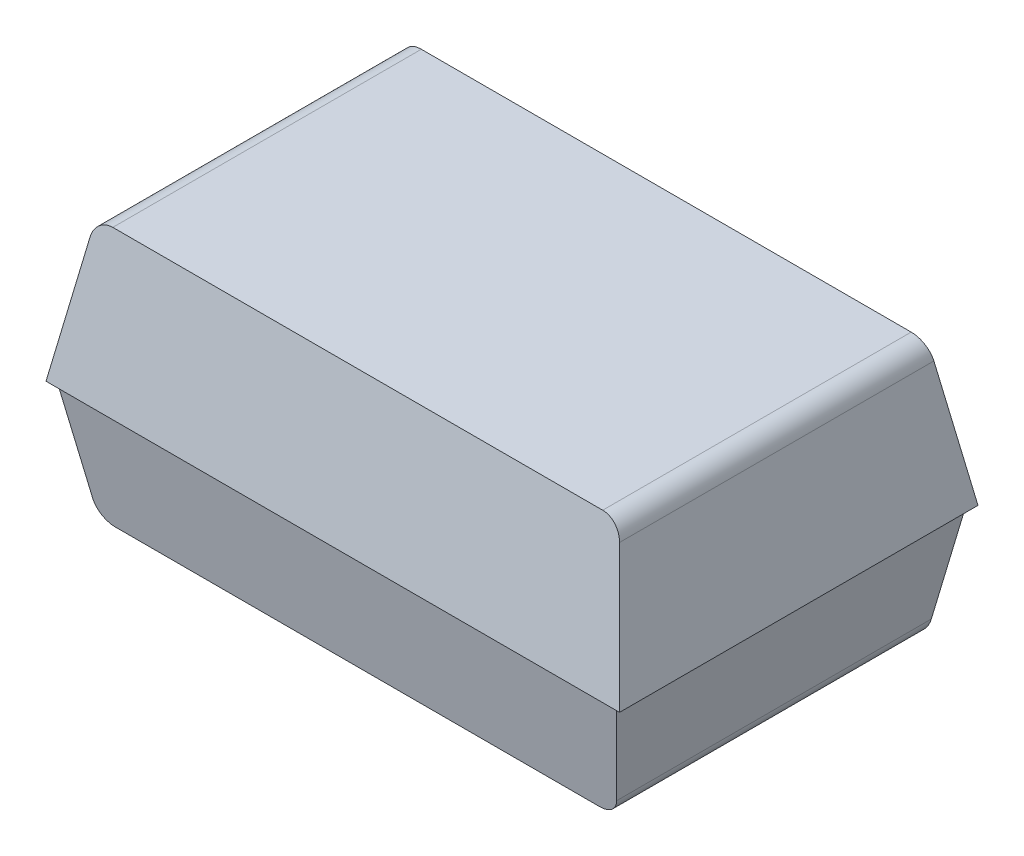
ISO-10303-21;
HEADER;
FILE_DESCRIPTION(('STEP AP214'),'2;1');
FILE_NAME('part.step','',(''),(''),'','','');
FILE_SCHEMA(('AUTOMOTIVE_DESIGN { 1 0 10303 214 1 1 1 1 }'));
ENDSEC;
DATA;
#1=APPLICATION_CONTEXT('core data for automotive mechanical design processes');
#2=APPLICATION_PROTOCOL_DEFINITION('international standard','automotive_design',2000,#1);
#3=PRODUCT_CONTEXT('',#1,'mechanical');
#4=PRODUCT('Part','Part','',(#3));
#5=PRODUCT_RELATED_PRODUCT_CATEGORY('part','',(#4));
#6=PRODUCT_DEFINITION_FORMATION('','',#4);
#7=PRODUCT_DEFINITION_CONTEXT('part definition',#1,'design');
#8=PRODUCT_DEFINITION('design','',#6,#7);
#9=PRODUCT_DEFINITION_SHAPE('','',#8);
#10=(LENGTH_UNIT() NAMED_UNIT(*) SI_UNIT(.MILLI.,.METRE.));
#11=(NAMED_UNIT(*) PLANE_ANGLE_UNIT() SI_UNIT($,.RADIAN.));
#12=(NAMED_UNIT(*) SI_UNIT($,.STERADIAN.) SOLID_ANGLE_UNIT());
#13=UNCERTAINTY_MEASURE_WITH_UNIT(LENGTH_MEASURE(1.E-05),#10,'distance_accuracy_value','');
#14=(GEOMETRIC_REPRESENTATION_CONTEXT(3) GLOBAL_UNCERTAINTY_ASSIGNED_CONTEXT((#13)) GLOBAL_UNIT_ASSIGNED_CONTEXT((#10,
#11,#12)) REPRESENTATION_CONTEXT('',''));
#15=CARTESIAN_POINT('',(0.,0.,0.));
#16=DIRECTION('',(0.,0.,1.));
#17=DIRECTION('',(1.,0.,0.));
#18=AXIS2_PLACEMENT_3D('',#15,#16,#17);
#19=CARTESIAN_POINT('',(-0.650643706322,-0.356,-0.320171743631));
#20=DIRECTION('',(0.,-1.,0.));
#21=DIRECTION('',(0.,0.,-1.));
#22=AXIS2_PLACEMENT_3D('',#19,#20,#21);
#23=PLANE('',#22);
#24=CARTESIAN_POINT('',(-0.650643706322,-0.356,-0.320171743631));
#25=DIRECTION('',(0.,1.,0.));
#26=DIRECTION('',(0.,0.,1.));
#27=AXIS2_PLACEMENT_3D('',#24,#25,#26);
#28=CIRCLE('',#27,0.108363966903);
#29=CARTESIAN_POINT('',(-0.650643706322,-0.356,-0.211807776728));
#30=VERTEX_POINT('',#29);
#31=EDGE_CURVE('E20',#30,#30,#28,.F.);
#32=ORIENTED_EDGE('',*,*,#31,.T.);
#33=EDGE_LOOP('',(#32));
#34=FACE_BOUND('',#33,.T.);
#35=ADVANCED_FACE('F17',(#34),#23,.T.);
#36=CARTESIAN_POINT('',(-0.650643706322,-0.406,-0.320171743631));
#37=DIRECTION('',(0.,1.,0.));
#38=DIRECTION('',(0.,0.,1.));
#39=AXIS2_PLACEMENT_3D('',#36,#37,#38);
#40=CYLINDRICAL_SURFACE('',#39,0.108363966903);
#41=CARTESIAN_POINT('',(-0.650643706322,-0.406,-0.320171743631));
#42=DIRECTION('',(0.,1.,0.));
#43=DIRECTION('',(0.,0.,1.));
#44=AXIS2_PLACEMENT_3D('',#41,#42,#43);
#45=CIRCLE('',#44,0.108363966903);
#46=CARTESIAN_POINT('',(-0.650643706322,-0.406,-0.211807776728));
#47=VERTEX_POINT('',#46);
#48=EDGE_CURVE('E145',#47,#47,#45,.T.);
#49=ORIENTED_EDGE('',*,*,#48,.F.);
#50=EDGE_LOOP('',(#49));
#51=FACE_BOUND('',#50,.T.);
#52=ORIENTED_EDGE('',*,*,#31,.F.);
#53=EDGE_LOOP('',(#52));
#54=FACE_BOUND('',#53,.T.);
#55=ADVANCED_FACE('F182',(#51,#54),#40,.F.);
#56=CARTESIAN_POINT('',(0.,-0.406,0.));
#57=DIRECTION('',(0.,-1.,0.));
#58=DIRECTION('',(0.,0.,-1.));
#59=AXIS2_PLACEMENT_3D('',#56,#57,#58);
#60=PLANE('',#59);
#61=DIRECTION('',(1.,0.,0.));
#62=VECTOR('',#61,1.);
#63=CARTESIAN_POINT('',(1.2,-0.406000000000055,0.53841124583231));
#64=LINE('',#63,#62);
#65=CARTESIAN_POINT('',(-0.84467427165,-0.406000000000014,0.538411245832314));
#66=VERTEX_POINT('',#65);
#67=CARTESIAN_POINT('',(0.84467427165,-0.406000000000014,0.538411245832314));
#68=VERTEX_POINT('',#67);
#69=EDGE_CURVE('E148',#66,#68,#64,.T.);
#70=ORIENTED_EDGE('',*,*,#69,.F.);
#71=DIRECTION('',(0.,0.,-1.));
#72=VECTOR('',#71,1.);
#73=CARTESIAN_POINT('',(-0.84467427165,-0.406,1.079009571055));
#74=LINE('',#73,#72);
#75=CARTESIAN_POINT('',(-0.84467427165,-0.406000000000014,-0.538411245832314));
#76=VERTEX_POINT('',#75);
#77=EDGE_CURVE('E98',#76,#66,#74,.F.);
#78=ORIENTED_EDGE('',*,*,#77,.F.);
#79=DIRECTION('',(1.,0.,0.));
#80=VECTOR('',#79,1.);
#81=CARTESIAN_POINT('',(1.2,-0.406000000000055,-0.53841124583231));
#82=LINE('',#81,#80);
#83=CARTESIAN_POINT('',(0.84467427165,-0.406000000000014,-0.538411245832314));
#84=VERTEX_POINT('',#83);
#85=EDGE_CURVE('E173',#76,#84,#82,.T.);
#86=ORIENTED_EDGE('',*,*,#85,.T.);
#87=DIRECTION('',(0.,0.,1.));
#88=VECTOR('',#87,1.);
#89=CARTESIAN_POINT('',(0.84467427165,-0.406,-1.078995464428));
#90=LINE('',#89,#88);
#91=EDGE_CURVE('E117',#68,#84,#90,.F.);
#92=ORIENTED_EDGE('',*,*,#91,.F.);
#93=EDGE_LOOP('',(#70,#78,#86,#92));
#94=FACE_BOUND('',#93,.T.);
#95=ORIENTED_EDGE('',*,*,#48,.T.);
#96=EDGE_LOOP('',(#95));
#97=FACE_BOUND('',#96,.T.);
#98=ADVANCED_FACE('F184',(#94,#97),#60,.T.);
#99=CARTESIAN_POINT('',(0.84467427165,-0.336,-1.078995464428));
#100=DIRECTION('',(0.,0.,1.));
#101=DIRECTION('',(1.,0.,0.));
#102=AXIS2_PLACEMENT_3D('',#99,#100,#101);
#103=CYLINDRICAL_SURFACE('',#102,0.07);
#104=CARTESIAN_POINT('',(0.84467427165,-0.336,0.55075413448192));
#105=DIRECTION('',(0.,-0.173648177667033,0.98480775301219));
#106=DIRECTION('',(0.,0.98480775301219,0.173648177667033));
#107=AXIS2_PLACEMENT_3D('',#104,#105,#106);
#108=ELLIPSE('',#107,0.0710798628320034,0.07);
#109=CARTESIAN_POINT('',(0.913610814360793,-0.348155372436795,0.548610814360751));
#110=VERTEX_POINT('',#109);
#111=EDGE_CURVE('E167',#68,#110,#108,.T.);
#112=ORIENTED_EDGE('',*,*,#111,.F.);
#113=ORIENTED_EDGE('',*,*,#91,.T.);
#114=CARTESIAN_POINT('',(0.84467427165,-0.336,-0.550754134481919));
#115=DIRECTION('',(0.,0.173648177667033,0.98480775301219));
#116=DIRECTION('',(0.,-0.98480775301219,0.173648177667033));
#117=AXIS2_PLACEMENT_3D('',#114,#115,#116);
#118=ELLIPSE('',#117,0.0710798628320034,0.07);
#119=CARTESIAN_POINT('',(0.913610814360788,-0.348155372436823,-0.548610814360885));
#120=VERTEX_POINT('',#119);
#121=EDGE_CURVE('E171',#84,#120,#118,.T.);
#122=ORIENTED_EDGE('',*,*,#121,.T.);
#123=DIRECTION('',(0.,0.,1.));
#124=VECTOR('',#123,1.);
#125=CARTESIAN_POINT('',(0.913610814360724,-0.348155372436951,0.61));
#126=LINE('',#125,#124);
#127=EDGE_CURVE('E135',#120,#110,#126,.T.);
#128=ORIENTED_EDGE('',*,*,#127,.T.);
#129=EDGE_LOOP('',(#112,#113,#122,#128));
#130=FACE_BOUND('',#129,.T.);
#131=ADVANCED_FACE('F191',(#130),#103,.T.);
#132=CARTESIAN_POINT('',(-0.84467427165,-0.336,1.079009571055));
#133=DIRECTION('',(0.,0.,-1.));
#134=DIRECTION('',(-1.,0.,0.));
#135=AXIS2_PLACEMENT_3D('',#132,#133,#134);
#136=CYLINDRICAL_SURFACE('',#135,0.07);
#137=CARTESIAN_POINT('',(-0.84467427165,-0.336,-0.55075413448192));
#138=DIRECTION('',(0.,0.173648177667033,0.98480775301219));
#139=DIRECTION('',(0.,0.98480775301219,-0.173648177667033));
#140=AXIS2_PLACEMENT_3D('',#137,#138,#139);
#141=ELLIPSE('',#140,0.0710798628320034,0.07);
#142=CARTESIAN_POINT('',(-0.913610814360793,-0.348155372436795,-0.548610814360751));
#143=VERTEX_POINT('',#142);
#144=EDGE_CURVE('E120',#143,#76,#141,.T.);
#145=ORIENTED_EDGE('',*,*,#144,.T.);
#146=ORIENTED_EDGE('',*,*,#77,.T.);
#147=CARTESIAN_POINT('',(-0.84467427165,-0.336,0.550754134481919));
#148=DIRECTION('',(0.,-0.173648177667033,0.98480775301219));
#149=DIRECTION('',(0.,-0.98480775301219,-0.173648177667033));
#150=AXIS2_PLACEMENT_3D('',#147,#148,#149);
#151=ELLIPSE('',#150,0.0710798628320034,0.07);
#152=CARTESIAN_POINT('',(-0.913610814360793,-0.348155372436795,0.548610814360751));
#153=VERTEX_POINT('',#152);
#154=EDGE_CURVE('E162',#153,#66,#151,.T.);
#155=ORIENTED_EDGE('',*,*,#154,.F.);
#156=DIRECTION('',(0.,0.,1.));
#157=VECTOR('',#156,1.);
#158=CARTESIAN_POINT('',(-0.913610814360724,-0.348155372436951,0.61));
#159=LINE('',#158,#157);
#160=EDGE_CURVE('E118',#143,#153,#159,.T.);
#161=ORIENTED_EDGE('',*,*,#160,.F.);
#162=EDGE_LOOP('',(#145,#146,#155,#161));
#163=FACE_BOUND('',#162,.T.);
#164=ADVANCED_FACE('F237',(#163),#136,.T.);
#165=CARTESIAN_POINT('',(1.2,0.494,-0.53789447153));
#166=DIRECTION('',(0.,-0.173648177667033,0.98480775301219));
#167=DIRECTION('',(0.,-0.98480775301219,-0.173648177667033));
#168=AXIS2_PLACEMENT_3D('',#165,#166,#167);
#169=PLANE('',#168);
#170=DIRECTION('',(1.,0.,0.));
#171=VECTOR('',#170,1.);
#172=CARTESIAN_POINT('',(0.,0.,-0.625));
#173=LINE('',#172,#171);
#174=CARTESIAN_POINT('',(1.00000000000002,0.,-0.625000000000012));
#175=VERTEX_POINT('',#174);
#176=CARTESIAN_POINT('',(-1.00000000000001,0.,-0.625));
#177=VERTEX_POINT('',#176);
#178=EDGE_CURVE('E277',#175,#177,#173,.F.);
#179=ORIENTED_EDGE('',*,*,#178,.T.);
#180=DIRECTION('',(-0.171087869746174,-0.970287525248008,-0.171087869744795));
#181=VECTOR('',#180,1.);
#182=CARTESIAN_POINT('',(-0.923094040058414,0.436155372436897,-0.548094040059));
#183=LINE('',#182,#181);
#184=CARTESIAN_POINT('',(-0.923094040058731,0.436155372436813,-0.548094040058725));
#185=VERTEX_POINT('',#184);
#186=EDGE_CURVE('E165',#185,#177,#183,.T.);
#187=ORIENTED_EDGE('',*,*,#186,.F.);
#188=CARTESIAN_POINT('',(-0.854157497348,0.424,-0.5502373601796));
#189=DIRECTION('',(0.,-0.173648177667033,0.98480775301219));
#190=DIRECTION('',(0.,0.98480775301219,0.173648177667033));
#191=AXIS2_PLACEMENT_3D('',#188,#189,#190);
#192=ELLIPSE('',#191,0.0710798628320034,0.07);
#193=CARTESIAN_POINT('',(-0.854157497348,0.494,-0.53789447153));
#194=VERTEX_POINT('',#193);
#195=EDGE_CURVE('E108',#194,#185,#192,.T.);
#196=ORIENTED_EDGE('',*,*,#195,.F.);
#197=DIRECTION('',(1.,0.,0.));
#198=VECTOR('',#197,1.);
#199=CARTESIAN_POINT('',(1.2,0.494,-0.53789447153));
#200=LINE('',#199,#198);
#201=CARTESIAN_POINT('',(0.854157497348,0.494,-0.53789447153));
#202=VERTEX_POINT('',#201);
#203=EDGE_CURVE('E97',#202,#194,#200,.F.);
#204=ORIENTED_EDGE('',*,*,#203,.F.);
#205=CARTESIAN_POINT('',(0.854157497348,0.424,-0.5502373601796));
#206=DIRECTION('',(0.,-0.173648177667033,0.98480775301219));
#207=DIRECTION('',(0.,-0.98480775301219,-0.173648177667033));
#208=AXIS2_PLACEMENT_3D('',#205,#206,#207);
#209=ELLIPSE('',#208,0.0710798628320034,0.07);
#210=CARTESIAN_POINT('',(0.923094040058882,0.436155372436789,-0.548094040058432));
#211=VERTEX_POINT('',#210);
#212=EDGE_CURVE('E91',#211,#202,#209,.T.);
#213=ORIENTED_EDGE('',*,*,#212,.F.);
#214=DIRECTION('',(-0.171087869744795,0.970287525248008,0.171087869746174));
#215=VECTOR('',#214,1.);
#216=CARTESIAN_POINT('',(1.,0.,-0.625000000000034));
#217=LINE('',#216,#215);
#218=EDGE_CURVE('E86',#175,#211,#217,.T.);
#219=ORIENTED_EDGE('',*,*,#218,.F.);
#220=EDGE_LOOP('',(#179,#187,#196,#204,#213,#219));
#221=FACE_BOUND('',#220,.T.);
#222=ADVANCED_FACE('F106',(#221),#169,.F.);
#223=CARTESIAN_POINT('',(-0.975,0.,0.61));
#224=DIRECTION('',(-0.98480775301219,-0.173648177667033,0.));
#225=DIRECTION('',(0.173648177667033,-0.98480775301219,0.));
#226=AXIS2_PLACEMENT_3D('',#223,#224,#225);
#227=PLANE('',#226);
#228=DIRECTION('',(0.171087869745387,-0.970287525247907,0.171087869746157));
#229=VECTOR('',#228,1.);
#230=CARTESIAN_POINT('',(-0.975000000000001,0.,-0.61));
#231=LINE('',#230,#229);
#232=CARTESIAN_POINT('',(-0.975000000000001,0.,-0.61));
#233=VERTEX_POINT('',#232);
#234=EDGE_CURVE('E138',#233,#143,#231,.T.);
#235=ORIENTED_EDGE('',*,*,#234,.T.);
#236=ORIENTED_EDGE('',*,*,#160,.T.);
#237=DIRECTION('',(0.171087869745387,-0.970287525247907,-0.171087869746157));
#238=VECTOR('',#237,1.);
#239=CARTESIAN_POINT('',(-0.975000000000001,0.,0.61));
#240=LINE('',#239,#238);
#241=CARTESIAN_POINT('',(-0.975000000000001,0.,0.61));
#242=VERTEX_POINT('',#241);
#243=EDGE_CURVE('E166',#242,#153,#240,.T.);
#244=ORIENTED_EDGE('',*,*,#243,.F.);
#245=DIRECTION('',(0.,0.,1.));
#246=VECTOR('',#245,1.);
#247=CARTESIAN_POINT('',(-0.975,0.,0.));
#248=LINE('',#247,#246);
#249=EDGE_CURVE('E128',#242,#233,#248,.F.);
#250=ORIENTED_EDGE('',*,*,#249,.T.);
#251=EDGE_LOOP('',(#235,#236,#244,#250));
#252=FACE_BOUND('',#251,.T.);
#253=ADVANCED_FACE('F230',(#252),#227,.T.);
#254=CARTESIAN_POINT('',(1.2,0.,-0.61));
#255=DIRECTION('',(0.,0.173648177667033,0.98480775301219));
#256=DIRECTION('',(0.,-0.98480775301219,0.173648177667033));
#257=AXIS2_PLACEMENT_3D('',#254,#255,#256);
#258=PLANE('',#257);
#259=DIRECTION('',(1.,0.,0.));
#260=VECTOR('',#259,1.);
#261=CARTESIAN_POINT('',(0.,0.,-0.61));
#262=LINE('',#261,#260);
#263=CARTESIAN_POINT('',(0.975,0.,-0.61));
#264=VERTEX_POINT('',#263);
#265=EDGE_CURVE('E131',#233,#264,#262,.T.);
#266=ORIENTED_EDGE('',*,*,#265,.T.);
#267=DIRECTION('',(-0.171087869746157,-0.970287525247907,0.171087869745386));
#268=VECTOR('',#267,1.);
#269=CARTESIAN_POINT('',(0.975,0.,-0.61));
#270=LINE('',#269,#268);
#271=EDGE_CURVE('E137',#264,#120,#270,.T.);
#272=ORIENTED_EDGE('',*,*,#271,.T.);
#273=ORIENTED_EDGE('',*,*,#121,.F.);
#274=ORIENTED_EDGE('',*,*,#85,.F.);
#275=ORIENTED_EDGE('',*,*,#144,.F.);
#276=ORIENTED_EDGE('',*,*,#234,.F.);
#277=EDGE_LOOP('',(#266,#272,#273,#274,#275,#276));
#278=FACE_BOUND('',#277,.T.);
#279=ADVANCED_FACE('F226',(#278),#258,.F.);
#280=CARTESIAN_POINT('',(0.975,0.,0.61));
#281=DIRECTION('',(-0.98480775301219,0.173648177667033,0.));
#282=DIRECTION('',(-0.173648177667033,-0.98480775301219,0.));
#283=AXIS2_PLACEMENT_3D('',#280,#281,#282);
#284=PLANE('',#283);
#285=DIRECTION('',(0.,0.,1.));
#286=VECTOR('',#285,1.);
#287=CARTESIAN_POINT('',(0.975,0.,0.));
#288=LINE('',#287,#286);
#289=CARTESIAN_POINT('',(0.975,0.,0.61));
#290=VERTEX_POINT('',#289);
#291=EDGE_CURVE('E125',#264,#290,#288,.T.);
#292=ORIENTED_EDGE('',*,*,#291,.T.);
#293=DIRECTION('',(0.171087869745386,0.970287525247907,0.171087869746157));
#294=VECTOR('',#293,1.);
#295=CARTESIAN_POINT('',(0.913610814361,-0.348155372436951,0.548610814360724));
#296=LINE('',#295,#294);
#297=EDGE_CURVE('E170',#110,#290,#296,.T.);
#298=ORIENTED_EDGE('',*,*,#297,.F.);
#299=ORIENTED_EDGE('',*,*,#127,.F.);
#300=ORIENTED_EDGE('',*,*,#271,.F.);
#301=EDGE_LOOP('',(#292,#298,#299,#300));
#302=FACE_BOUND('',#301,.T.);
#303=ADVANCED_FACE('F222',(#302),#284,.F.);
#304=CARTESIAN_POINT('',(1.2,0.,0.61));
#305=DIRECTION('',(0.,-0.173648177667033,0.98480775301219));
#306=DIRECTION('',(0.,-0.98480775301219,-0.173648177667033));
#307=AXIS2_PLACEMENT_3D('',#304,#305,#306);
#308=PLANE('',#307);
#309=ORIENTED_EDGE('',*,*,#243,.T.);
#310=ORIENTED_EDGE('',*,*,#154,.T.);
#311=ORIENTED_EDGE('',*,*,#69,.T.);
#312=ORIENTED_EDGE('',*,*,#111,.T.);
#313=ORIENTED_EDGE('',*,*,#297,.T.);
#314=DIRECTION('',(1.,0.,0.));
#315=VECTOR('',#314,1.);
#316=CARTESIAN_POINT('',(0.,0.,0.61));
#317=LINE('',#316,#315);
#318=EDGE_CURVE('E121',#290,#242,#317,.F.);
#319=ORIENTED_EDGE('',*,*,#318,.T.);
#320=EDGE_LOOP('',(#309,#310,#311,#312,#313,#319));
#321=FACE_BOUND('',#320,.T.);
#322=ADVANCED_FACE('F218',(#321),#308,.T.);
#323=CARTESIAN_POINT('',(-0.91289447153,0.494,0.625));
#324=DIRECTION('',(-0.98480775301219,0.173648177667033,0.));
#325=DIRECTION('',(-0.173648177667033,-0.98480775301219,0.));
#326=AXIS2_PLACEMENT_3D('',#323,#324,#325);
#327=PLANE('',#326);
#328=DIRECTION('',(-0.171087869744795,-0.970287525248008,0.171087869746174));
#329=VECTOR('',#328,1.);
#330=CARTESIAN_POINT('',(-0.923094040059001,0.436155372436897,0.548094040058414));
#331=LINE('',#330,#329);
#332=CARTESIAN_POINT('',(-0.923094040058882,0.436155372436789,0.548094040058432));
#333=VERTEX_POINT('',#332);
#334=CARTESIAN_POINT('',(-1.,0.,0.625000000000034));
#335=VERTEX_POINT('',#334);
#336=EDGE_CURVE('E160',#333,#335,#331,.T.);
#337=ORIENTED_EDGE('',*,*,#336,.F.);
#338=DIRECTION('',(0.,0.,1.));
#339=VECTOR('',#338,1.);
#340=CARTESIAN_POINT('',(-0.923094040058805,0.436155372436966,-1.077973923262));
#341=LINE('',#340,#339);
#342=EDGE_CURVE('E161',#185,#333,#341,.T.);
#343=ORIENTED_EDGE('',*,*,#342,.F.);
#344=ORIENTED_EDGE('',*,*,#186,.T.);
#345=DIRECTION('',(0.,0.,1.));
#346=VECTOR('',#345,1.);
#347=CARTESIAN_POINT('',(-1.,0.,0.));
#348=LINE('',#347,#346);
#349=EDGE_CURVE('E132',#177,#335,#348,.T.);
#350=ORIENTED_EDGE('',*,*,#349,.T.);
#351=EDGE_LOOP('',(#337,#343,#344,#350));
#352=FACE_BOUND('',#351,.T.);
#353=ADVANCED_FACE('F214',(#352),#327,.T.);
#354=CARTESIAN_POINT('',(0.,0.,0.));
#355=DIRECTION('',(0.,1.,0.));
#356=DIRECTION('',(0.,0.,1.));
#357=AXIS2_PLACEMENT_3D('',#354,#355,#356);
#358=PLANE('',#357);
#359=ORIENTED_EDGE('',*,*,#291,.F.);
#360=ORIENTED_EDGE('',*,*,#265,.F.);
#361=ORIENTED_EDGE('',*,*,#249,.F.);
#362=ORIENTED_EDGE('',*,*,#318,.F.);
#363=EDGE_LOOP('',(#359,#360,#361,#362));
#364=FACE_BOUND('',#363,.T.);
#365=ORIENTED_EDGE('',*,*,#349,.F.);
#366=ORIENTED_EDGE('',*,*,#178,.F.);
#367=DIRECTION('',(0.,0.,1.));
#368=VECTOR('',#367,1.);
#369=CARTESIAN_POINT('',(1.00000000000003,0.,0.625));
#370=LINE('',#369,#368);
#371=CARTESIAN_POINT('',(1.00000000000001,0.,0.625000000000034));
#372=VERTEX_POINT('',#371);
#373=EDGE_CURVE('E124',#175,#372,#370,.T.);
#374=ORIENTED_EDGE('',*,*,#373,.T.);
#375=DIRECTION('',(1.,0.,0.));
#376=VECTOR('',#375,1.);
#377=CARTESIAN_POINT('',(1.2,0.,0.625000000000034));
#378=LINE('',#377,#376);
#379=EDGE_CURVE('E289',#335,#372,#378,.T.);
#380=ORIENTED_EDGE('',*,*,#379,.F.);
#381=EDGE_LOOP('',(#365,#366,#374,#380));
#382=FACE_BOUND('',#381,.T.);
#383=ADVANCED_FACE('F211',(#364,#382),#358,.F.);
#384=CARTESIAN_POINT('',(0.91289447153,0.494,0.625));
#385=DIRECTION('',(-0.98480775301219,-0.173648177667033,0.));
#386=DIRECTION('',(0.173648177667033,-0.98480775301219,0.));
#387=AXIS2_PLACEMENT_3D('',#384,#385,#386);
#388=PLANE('',#387);
#389=ORIENTED_EDGE('',*,*,#373,.F.);
#390=ORIENTED_EDGE('',*,*,#218,.T.);
#391=DIRECTION('',(0.,0.,-1.));
#392=VECTOR('',#391,1.);
#393=CARTESIAN_POINT('',(0.923094040058805,0.436155372436966,1.077959830175));
#394=LINE('',#393,#392);
#395=CARTESIAN_POINT('',(0.923094040058882,0.436155372436789,0.548094040058431));
#396=VERTEX_POINT('',#395);
#397=EDGE_CURVE('E94',#396,#211,#394,.T.);
#398=ORIENTED_EDGE('',*,*,#397,.F.);
#399=DIRECTION('',(-0.171087869744795,0.970287525248008,-0.171087869746174));
#400=VECTOR('',#399,1.);
#401=CARTESIAN_POINT('',(1.,0.,0.625000000000034));
#402=LINE('',#401,#400);
#403=EDGE_CURVE('E156',#372,#396,#402,.T.);
#404=ORIENTED_EDGE('',*,*,#403,.F.);
#405=EDGE_LOOP('',(#389,#390,#398,#404));
#406=FACE_BOUND('',#405,.T.);
#407=ADVANCED_FACE('F207',(#406),#388,.F.);
#408=CARTESIAN_POINT('',(-0.854157497348,0.424,-1.077973923262));
#409=DIRECTION('',(0.,0.,1.));
#410=DIRECTION('',(1.,0.,0.));
#411=AXIS2_PLACEMENT_3D('',#408,#409,#410);
#412=CYLINDRICAL_SURFACE('',#411,0.07);
#413=CARTESIAN_POINT('',(-0.854157497348,0.424,0.5502373601796));
#414=DIRECTION('',(0.,0.173648177667033,0.98480775301219));
#415=DIRECTION('',(0.,-0.98480775301219,0.173648177667033));
#416=AXIS2_PLACEMENT_3D('',#413,#414,#415);
#417=ELLIPSE('',#416,0.0710798628320034,0.07);
#418=CARTESIAN_POINT('',(-0.854157497348,0.494,0.53789447153));
#419=VERTEX_POINT('',#418);
#420=EDGE_CURVE('E157',#419,#333,#417,.T.);
#421=ORIENTED_EDGE('',*,*,#420,.F.);
#422=DIRECTION('',(0.,0.,1.));
#423=VECTOR('',#422,1.);
#424=CARTESIAN_POINT('',(-0.854157497348,0.494,0.));
#425=LINE('',#424,#423);
#426=EDGE_CURVE('E297',#194,#419,#425,.T.);
#427=ORIENTED_EDGE('',*,*,#426,.F.);
#428=ORIENTED_EDGE('',*,*,#195,.T.);
#429=ORIENTED_EDGE('',*,*,#342,.T.);
#430=EDGE_LOOP('',(#421,#427,#428,#429));
#431=FACE_BOUND('',#430,.T.);
#432=ADVANCED_FACE('F204',(#431),#412,.T.);
#433=CARTESIAN_POINT('',(1.2,0.494,0.53789447153));
#434=DIRECTION('',(0.,0.173648177667033,0.98480775301219));
#435=DIRECTION('',(0.,-0.98480775301219,0.173648177667033));
#436=AXIS2_PLACEMENT_3D('',#433,#434,#435);
#437=PLANE('',#436);
#438=ORIENTED_EDGE('',*,*,#403,.T.);
#439=CARTESIAN_POINT('',(0.854157497348,0.424,0.5502373601796));
#440=DIRECTION('',(0.,0.173648177667033,0.98480775301219));
#441=DIRECTION('',(0.,0.98480775301219,-0.173648177667033));
#442=AXIS2_PLACEMENT_3D('',#439,#440,#441);
#443=ELLIPSE('',#442,0.0710798628320034,0.07);
#444=CARTESIAN_POINT('',(0.854157497348,0.494,0.53789447153));
#445=VERTEX_POINT('',#444);
#446=EDGE_CURVE('E35',#445,#396,#443,.F.);
#447=ORIENTED_EDGE('',*,*,#446,.F.);
#448=DIRECTION('',(1.,0.,0.));
#449=VECTOR('',#448,1.);
#450=CARTESIAN_POINT('',(0.,0.494,0.53789447153));
#451=LINE('',#450,#449);
#452=EDGE_CURVE('E26',#419,#445,#451,.T.);
#453=ORIENTED_EDGE('',*,*,#452,.F.);
#454=ORIENTED_EDGE('',*,*,#420,.T.);
#455=ORIENTED_EDGE('',*,*,#336,.T.);
#456=ORIENTED_EDGE('',*,*,#379,.T.);
#457=EDGE_LOOP('',(#438,#447,#453,#454,#455,#456));
#458=FACE_BOUND('',#457,.T.);
#459=ADVANCED_FACE('F199',(#458),#437,.T.);
#460=CARTESIAN_POINT('',(0.854157497348,0.424,1.077959830175));
#461=DIRECTION('',(0.,0.,-1.));
#462=DIRECTION('',(-1.,0.,0.));
#463=AXIS2_PLACEMENT_3D('',#460,#461,#462);
#464=CYLINDRICAL_SURFACE('',#463,0.07);
#465=ORIENTED_EDGE('',*,*,#212,.T.);
#466=DIRECTION('',(0.,0.,1.));
#467=VECTOR('',#466,1.);
#468=CARTESIAN_POINT('',(0.854157497348,0.494,0.));
#469=LINE('',#468,#467);
#470=EDGE_CURVE('E11',#445,#202,#469,.F.);
#471=ORIENTED_EDGE('',*,*,#470,.F.);
#472=ORIENTED_EDGE('',*,*,#446,.T.);
#473=ORIENTED_EDGE('',*,*,#397,.T.);
#474=EDGE_LOOP('',(#465,#471,#472,#473));
#475=FACE_BOUND('',#474,.T.);
#476=ADVANCED_FACE('F92',(#475),#464,.T.);
#477=CARTESIAN_POINT('',(0.,0.494,0.));
#478=DIRECTION('',(0.,1.,0.));
#479=DIRECTION('',(0.,0.,1.));
#480=AXIS2_PLACEMENT_3D('',#477,#478,#479);
#481=PLANE('',#480);
#482=ORIENTED_EDGE('',*,*,#452,.T.);
#483=ORIENTED_EDGE('',*,*,#470,.T.);
#484=ORIENTED_EDGE('',*,*,#203,.T.);
#485=ORIENTED_EDGE('',*,*,#426,.T.);
#486=EDGE_LOOP('',(#482,#483,#484,#485));
#487=FACE_BOUND('',#486,.T.);
#488=ADVANCED_FACE('F101',(#487),#481,.T.);
#489=CLOSED_SHELL('',(#35,#55,#98,#131,#164,#222,#253,#279,#303,#322,#353,#383,#407,#432,#459,
#476,#488));
#490=MANIFOLD_SOLID_BREP('B1',#489);
#491=ADVANCED_BREP_SHAPE_REPRESENTATION('',(#18,#490),#14);
#492=SHAPE_DEFINITION_REPRESENTATION(#9,#491);
ENDSEC;
END-ISO-10303-21;
